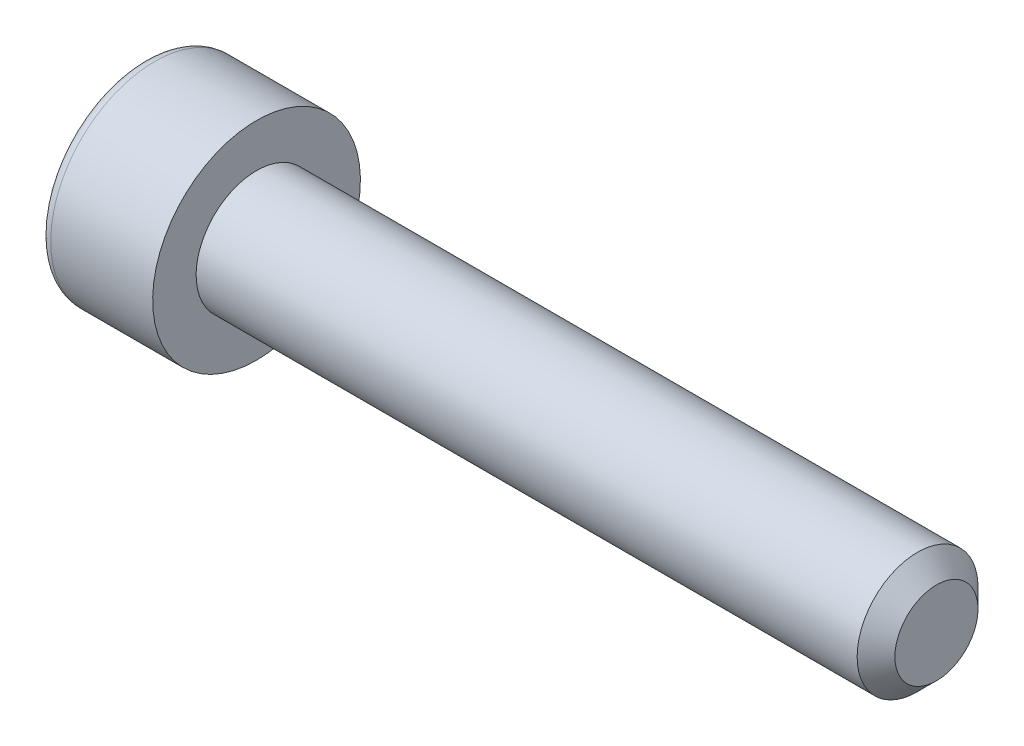
ISO-10303-21;
HEADER;
FILE_DESCRIPTION(('STEP AP214'),'2;1');
FILE_NAME('part.step','',(''),(''),'','','');
FILE_SCHEMA(('AUTOMOTIVE_DESIGN { 1 0 10303 214 1 1 1 1 }'));
ENDSEC;
DATA;
#1=APPLICATION_CONTEXT('core data for automotive mechanical design processes');
#2=APPLICATION_PROTOCOL_DEFINITION('international standard','automotive_design',2000,#1);
#3=PRODUCT_CONTEXT('',#1,'mechanical');
#4=PRODUCT('Part','Part','',(#3));
#5=PRODUCT_RELATED_PRODUCT_CATEGORY('part','',(#4));
#6=PRODUCT_DEFINITION_FORMATION('','',#4);
#7=PRODUCT_DEFINITION_CONTEXT('part definition',#1,'design');
#8=PRODUCT_DEFINITION('design','',#6,#7);
#9=PRODUCT_DEFINITION_SHAPE('','',#8);
#10=(LENGTH_UNIT() NAMED_UNIT(*) SI_UNIT(.MILLI.,.METRE.));
#11=(NAMED_UNIT(*) PLANE_ANGLE_UNIT() SI_UNIT($,.RADIAN.));
#12=(NAMED_UNIT(*) SI_UNIT($,.STERADIAN.) SOLID_ANGLE_UNIT());
#13=UNCERTAINTY_MEASURE_WITH_UNIT(LENGTH_MEASURE(1.E-05),#10,'distance_accuracy_value','');
#14=(GEOMETRIC_REPRESENTATION_CONTEXT(3) GLOBAL_UNCERTAINTY_ASSIGNED_CONTEXT((#13)) GLOBAL_UNIT_ASSIGNED_CONTEXT((#10,
#11,#12)) REPRESENTATION_CONTEXT('',''));
#15=CARTESIAN_POINT('',(0.,0.,0.));
#16=DIRECTION('',(0.,0.,1.));
#17=DIRECTION('',(1.,0.,0.));
#18=AXIS2_PLACEMENT_3D('',#15,#16,#17);
#19=CARTESIAN_POINT('',(-1.70000000002801,0.,0.));
#20=DIRECTION('',(-1.,0.,0.));
#21=DIRECTION('',(0.,0.,1.));
#22=AXIS2_PLACEMENT_3D('',#19,#20,#21);
#23=CONICAL_SURFACE('',#22,1.43650000001117,1.04719755119831);
#24=CARTESIAN_POINT('',(-0.870636338333952,0.,0.));
#25=VERTEX_POINT('',#24);
#26=VERTEX_LOOP('',#25);
#27=FACE_BOUND('',#26,.T.);
#28=CARTESIAN_POINT('',(-1.69999999996238,0.,0.));
#29=DIRECTION('',(-1.,0.,0.));
#30=DIRECTION('',(0.,0.,1.));
#31=AXIS2_PLACEMENT_3D('',#28,#29,#30);
#32=CIRCLE('',#31,1.43649999989748);
#33=CARTESIAN_POINT('',(-1.69999999996238,-0.718249999948738,-1.24404549244756));
#34=VERTEX_POINT('',#33);
#35=CARTESIAN_POINT('',(-1.69999999996238,-1.43649999989748,0.));
#36=VERTEX_POINT('',#35);
#37=EDGE_CURVE('E128',#34,#36,#32,.T.);
#38=ORIENTED_EDGE('',*,*,#37,.T.);
#39=CARTESIAN_POINT('',(-1.70000000002801,0.,0.));
#40=DIRECTION('',(-1.,0.,0.));
#41=DIRECTION('',(0.,0.,1.));
#42=AXIS2_PLACEMENT_3D('',#39,#40,#41);
#43=CIRCLE('',#42,1.43650000001117);
#44=CARTESIAN_POINT('',(-1.70000000002801,-0.718250000005583,1.24404549254602));
#45=VERTEX_POINT('',#44);
#46=EDGE_CURVE('E78',#36,#45,#43,.T.);
#47=ORIENTED_EDGE('',*,*,#46,.T.);
#48=CARTESIAN_POINT('',(-1.70000000002801,0.,0.));
#49=DIRECTION('',(-1.,0.,0.));
#50=DIRECTION('',(0.,0.,1.));
#51=AXIS2_PLACEMENT_3D('',#48,#49,#50);
#52=CIRCLE('',#51,1.43650000001117);
#53=CARTESIAN_POINT('',(-1.70000000002801,0.718250000005582,1.24404549254602));
#54=VERTEX_POINT('',#53);
#55=EDGE_CURVE('E136',#45,#54,#52,.T.);
#56=ORIENTED_EDGE('',*,*,#55,.T.);
#57=CARTESIAN_POINT('',(-1.70000000002801,0.,0.));
#58=DIRECTION('',(-1.,0.,0.));
#59=DIRECTION('',(0.,0.,1.));
#60=AXIS2_PLACEMENT_3D('',#57,#58,#59);
#61=CIRCLE('',#60,1.43650000001116);
#62=CARTESIAN_POINT('',(-1.70000000001401,1.43650000000558,9.66880570697553E-12));
#63=VERTEX_POINT('',#62);
#64=EDGE_CURVE('E134',#54,#63,#61,.T.);
#65=ORIENTED_EDGE('',*,*,#64,.T.);
#66=CARTESIAN_POINT('',(-1.70000000002801,0.,0.));
#67=DIRECTION('',(-1.,0.,0.));
#68=DIRECTION('',(0.,0.,1.));
#69=AXIS2_PLACEMENT_3D('',#66,#67,#68);
#70=CIRCLE('',#69,1.43650000001117);
#71=CARTESIAN_POINT('',(-1.70000000002801,0.718250000005581,-1.24404549254602));
#72=VERTEX_POINT('',#71);
#73=EDGE_CURVE('E132',#63,#72,#70,.T.);
#74=ORIENTED_EDGE('',*,*,#73,.T.);
#75=CARTESIAN_POINT('',(-1.70000000002801,0.,0.));
#76=DIRECTION('',(-1.,0.,0.));
#77=DIRECTION('',(0.,0.,1.));
#78=AXIS2_PLACEMENT_3D('',#75,#76,#77);
#79=CIRCLE('',#78,1.43650000001117);
#80=EDGE_CURVE('E130',#72,#34,#79,.T.);
#81=ORIENTED_EDGE('',*,*,#80,.T.);
#82=EDGE_LOOP('',(#38,#47,#56,#65,#74,#81));
#83=FACE_BOUND('',#82,.T.);
#84=ADVANCED_FACE('F18',(#27,#83),#23,.F.);
#85=CARTESIAN_POINT('',(-1.7,0.,0.));
#86=DIRECTION('',(-1.,0.,0.));
#87=DIRECTION('',(0.,-1.,0.));
#88=AXIS2_PLACEMENT_3D('',#85,#86,#87);
#89=PLANE('',#88);
#90=ORIENTED_EDGE('',*,*,#55,.F.);
#91=DIRECTION('',(0.,1.,0.));
#92=VECTOR('',#91,1.);
#93=CARTESIAN_POINT('',(-1.7,-0.71825,1.24404549253635));
#94=LINE('',#93,#92);
#95=EDGE_CURVE('E92',#45,#54,#94,.T.);
#96=ORIENTED_EDGE('',*,*,#95,.T.);
#97=EDGE_LOOP('',(#90,#96));
#98=FACE_BOUND('',#97,.T.);
#99=ADVANCED_FACE('F201',(#98),#89,.F.);
#100=CARTESIAN_POINT('',(-1.7,0.,0.));
#101=DIRECTION('',(-1.,0.,0.));
#102=DIRECTION('',(0.,-1.,0.));
#103=AXIS2_PLACEMENT_3D('',#100,#101,#102);
#104=PLANE('',#103);
#105=ORIENTED_EDGE('',*,*,#64,.F.);
#106=DIRECTION('',(0.,-0.5,0.866025403784439));
#107=VECTOR('',#106,1.);
#108=CARTESIAN_POINT('',(-1.7,0.71825,1.24404549253635));
#109=LINE('',#108,#107);
#110=EDGE_CURVE('E414',#54,#63,#109,.F.);
#111=ORIENTED_EDGE('',*,*,#110,.T.);
#112=EDGE_LOOP('',(#105,#111));
#113=FACE_BOUND('',#112,.T.);
#114=ADVANCED_FACE('F198',(#113),#104,.F.);
#115=CARTESIAN_POINT('',(-1.7,0.,0.));
#116=DIRECTION('',(-1.,0.,0.));
#117=DIRECTION('',(0.,-1.,0.));
#118=AXIS2_PLACEMENT_3D('',#115,#116,#117);
#119=PLANE('',#118);
#120=ORIENTED_EDGE('',*,*,#73,.F.);
#121=DIRECTION('',(0.,0.5,0.866025403784439));
#122=VECTOR('',#121,1.);
#123=CARTESIAN_POINT('',(-1.7,1.4365,0.));
#124=LINE('',#123,#122);
#125=EDGE_CURVE('E403',#63,#72,#124,.F.);
#126=ORIENTED_EDGE('',*,*,#125,.T.);
#127=EDGE_LOOP('',(#120,#126));
#128=FACE_BOUND('',#127,.T.);
#129=ADVANCED_FACE('F194',(#128),#119,.F.);
#130=CARTESIAN_POINT('',(-1.7,0.,0.));
#131=DIRECTION('',(-1.,0.,0.));
#132=DIRECTION('',(0.,-1.,0.));
#133=AXIS2_PLACEMENT_3D('',#130,#131,#132);
#134=PLANE('',#133);
#135=ORIENTED_EDGE('',*,*,#80,.F.);
#136=DIRECTION('',(0.,1.,0.));
#137=VECTOR('',#136,1.);
#138=CARTESIAN_POINT('',(-1.7,0.71825,-1.24404549253635));
#139=LINE('',#138,#137);
#140=EDGE_CURVE('E392',#72,#34,#139,.F.);
#141=ORIENTED_EDGE('',*,*,#140,.T.);
#142=EDGE_LOOP('',(#135,#141));
#143=FACE_BOUND('',#142,.T.);
#144=ADVANCED_FACE('F190',(#143),#134,.F.);
#145=CARTESIAN_POINT('',(-1.7,0.,0.));
#146=DIRECTION('',(-1.,0.,0.));
#147=DIRECTION('',(0.,-1.,0.));
#148=AXIS2_PLACEMENT_3D('',#145,#146,#147);
#149=PLANE('',#148);
#150=ORIENTED_EDGE('',*,*,#37,.F.);
#151=DIRECTION('',(0.,0.499999999999999,-0.866025403784439));
#152=VECTOR('',#151,1.);
#153=CARTESIAN_POINT('',(-1.7,-0.71825,-1.24404549253635));
#154=LINE('',#153,#152);
#155=EDGE_CURVE('E374',#34,#36,#154,.F.);
#156=ORIENTED_EDGE('',*,*,#155,.T.);
#157=EDGE_LOOP('',(#150,#156));
#158=FACE_BOUND('',#157,.T.);
#159=ADVANCED_FACE('F186',(#158),#149,.F.);
#160=CARTESIAN_POINT('',(-1.7,0.,0.));
#161=DIRECTION('',(-1.,0.,0.));
#162=DIRECTION('',(0.,-1.,0.));
#163=AXIS2_PLACEMENT_3D('',#160,#161,#162);
#164=PLANE('',#163);
#165=ORIENTED_EDGE('',*,*,#46,.F.);
#166=DIRECTION('',(0.,-0.5,-0.866025403784439));
#167=VECTOR('',#166,1.);
#168=CARTESIAN_POINT('',(-1.7,-1.4365,0.));
#169=LINE('',#168,#167);
#170=EDGE_CURVE('E95',#36,#45,#169,.F.);
#171=ORIENTED_EDGE('',*,*,#170,.T.);
#172=EDGE_LOOP('',(#165,#171));
#173=FACE_BOUND('',#172,.T.);
#174=ADVANCED_FACE('F183',(#173),#164,.F.);
#175=CARTESIAN_POINT('',(-1.7,-0.71825,1.24404549253635));
#176=DIRECTION('',(0.,0.,1.));
#177=DIRECTION('',(1.,0.,0.));
#178=AXIS2_PLACEMENT_3D('',#175,#176,#177);
#179=PLANE('',#178);
#180=DIRECTION('',(1.,0.,0.));
#181=VECTOR('',#180,1.);
#182=CARTESIAN_POINT('',(-1.7,0.71825,1.24404549253635));
#183=LINE('',#182,#181);
#184=CARTESIAN_POINT('',(-3.,0.71825,1.24404549253635));
#185=VERTEX_POINT('',#184);
#186=EDGE_CURVE('E379',#185,#54,#183,.T.);
#187=ORIENTED_EDGE('',*,*,#186,.T.);
#188=ORIENTED_EDGE('',*,*,#95,.F.);
#189=DIRECTION('',(1.,0.,0.));
#190=VECTOR('',#189,1.);
#191=CARTESIAN_POINT('',(-1.7,-0.718250000000002,1.24404549253635));
#192=LINE('',#191,#190);
#193=CARTESIAN_POINT('',(-3.,-0.718250000000001,1.24404549253635));
#194=VERTEX_POINT('',#193);
#195=EDGE_CURVE('E84',#45,#194,#192,.F.);
#196=ORIENTED_EDGE('',*,*,#195,.T.);
#197=DIRECTION('',(0.,1.,0.));
#198=VECTOR('',#197,1.);
#199=CARTESIAN_POINT('',(-3.,1.4365,1.24404549253635));
#200=LINE('',#199,#198);
#201=EDGE_CURVE('E89',#194,#185,#200,.T.);
#202=ORIENTED_EDGE('',*,*,#201,.T.);
#203=EDGE_LOOP('',(#187,#188,#196,#202));
#204=FACE_BOUND('',#203,.T.);
#205=ADVANCED_FACE('F87',(#204),#179,.F.);
#206=CARTESIAN_POINT('',(-1.7,0.71825,1.24404549253635));
#207=DIRECTION('',(0.,0.866025403784439,0.5));
#208=DIRECTION('',(0.,-0.5,0.866025403784439));
#209=AXIS2_PLACEMENT_3D('',#206,#207,#208);
#210=PLANE('',#209);
#211=DIRECTION('',(1.,0.,0.));
#212=VECTOR('',#211,1.);
#213=CARTESIAN_POINT('',(-1.7,1.4365,0.));
#214=LINE('',#213,#212);
#215=CARTESIAN_POINT('',(-3.,1.4365,0.));
#216=VERTEX_POINT('',#215);
#217=EDGE_CURVE('E408',#216,#63,#214,.T.);
#218=ORIENTED_EDGE('',*,*,#217,.T.);
#219=ORIENTED_EDGE('',*,*,#110,.F.);
#220=ORIENTED_EDGE('',*,*,#186,.F.);
#221=DIRECTION('',(0.,0.499999999999999,-0.866025403784439));
#222=VECTOR('',#221,1.);
#223=CARTESIAN_POINT('',(-3.,0.71825,1.24404549253635));
#224=LINE('',#223,#222);
#225=EDGE_CURVE('E110',#185,#216,#224,.T.);
#226=ORIENTED_EDGE('',*,*,#225,.T.);
#227=EDGE_LOOP('',(#218,#219,#220,#226));
#228=FACE_BOUND('',#227,.T.);
#229=ADVANCED_FACE('F176',(#228),#210,.F.);
#230=CARTESIAN_POINT('',(-1.7,1.4365,0.));
#231=DIRECTION('',(0.,0.866025403784439,-0.5));
#232=DIRECTION('',(0.,0.5,0.866025403784439));
#233=AXIS2_PLACEMENT_3D('',#230,#231,#232);
#234=PLANE('',#233);
#235=DIRECTION('',(-1.,0.,0.));
#236=VECTOR('',#235,1.);
#237=CARTESIAN_POINT('',(-1.7,0.71825,-1.24404549253635));
#238=LINE('',#237,#236);
#239=CARTESIAN_POINT('',(-3.,0.71825,-1.24404549253635));
#240=VERTEX_POINT('',#239);
#241=EDGE_CURVE('E397',#240,#72,#238,.F.);
#242=ORIENTED_EDGE('',*,*,#241,.T.);
#243=ORIENTED_EDGE('',*,*,#125,.F.);
#244=ORIENTED_EDGE('',*,*,#217,.F.);
#245=DIRECTION('',(0.,-0.500000000000001,-0.866025403784438));
#246=VECTOR('',#245,1.);
#247=CARTESIAN_POINT('',(-3.,1.4365,0.));
#248=LINE('',#247,#246);
#249=EDGE_CURVE('E112',#216,#240,#248,.T.);
#250=ORIENTED_EDGE('',*,*,#249,.T.);
#251=EDGE_LOOP('',(#242,#243,#244,#250));
#252=FACE_BOUND('',#251,.T.);
#253=ADVANCED_FACE('F172',(#252),#234,.F.);
#254=CARTESIAN_POINT('',(-1.7,0.71825,-1.24404549253635));
#255=DIRECTION('',(0.,0.,-1.));
#256=DIRECTION('',(-1.,0.,0.));
#257=AXIS2_PLACEMENT_3D('',#254,#255,#256);
#258=PLANE('',#257);
#259=DIRECTION('',(1.,0.,0.));
#260=VECTOR('',#259,1.);
#261=CARTESIAN_POINT('',(-1.7,-0.71825,-1.24404549253635));
#262=LINE('',#261,#260);
#263=CARTESIAN_POINT('',(-3.,-0.71825,-1.24404549253635));
#264=VERTEX_POINT('',#263);
#265=EDGE_CURVE('E383',#264,#34,#262,.T.);
#266=ORIENTED_EDGE('',*,*,#265,.T.);
#267=ORIENTED_EDGE('',*,*,#140,.F.);
#268=ORIENTED_EDGE('',*,*,#241,.F.);
#269=DIRECTION('',(0.,1.,0.));
#270=VECTOR('',#269,1.);
#271=CARTESIAN_POINT('',(-3.,1.4365,-1.24404549253634));
#272=LINE('',#271,#270);
#273=EDGE_CURVE('E385',#240,#264,#272,.F.);
#274=ORIENTED_EDGE('',*,*,#273,.T.);
#275=EDGE_LOOP('',(#266,#267,#268,#274));
#276=FACE_BOUND('',#275,.T.);
#277=ADVANCED_FACE('F168',(#276),#258,.F.);
#278=CARTESIAN_POINT('',(-1.7,-0.71825,-1.24404549253635));
#279=DIRECTION('',(0.,-0.866025403784439,-0.499999999999999));
#280=DIRECTION('',(0.,0.499999999999999,-0.866025403784439));
#281=AXIS2_PLACEMENT_3D('',#278,#279,#280);
#282=PLANE('',#281);
#283=DIRECTION('',(1.,0.,0.));
#284=VECTOR('',#283,1.);
#285=CARTESIAN_POINT('',(-1.7,-1.4365,0.));
#286=LINE('',#285,#284);
#287=CARTESIAN_POINT('',(-3.,-1.4365,0.));
#288=VERTEX_POINT('',#287);
#289=EDGE_CURVE('E102',#288,#36,#286,.T.);
#290=ORIENTED_EDGE('',*,*,#289,.T.);
#291=ORIENTED_EDGE('',*,*,#155,.F.);
#292=ORIENTED_EDGE('',*,*,#265,.F.);
#293=DIRECTION('',(0.,-0.499999999999999,0.866025403784439));
#294=VECTOR('',#293,1.);
#295=CARTESIAN_POINT('',(-3.,-0.71825,-1.24404549253635));
#296=LINE('',#295,#294);
#297=EDGE_CURVE('E105',#264,#288,#296,.T.);
#298=ORIENTED_EDGE('',*,*,#297,.T.);
#299=EDGE_LOOP('',(#290,#291,#292,#298));
#300=FACE_BOUND('',#299,.T.);
#301=ADVANCED_FACE('F165',(#300),#282,.F.);
#302=CARTESIAN_POINT('',(-1.7,-1.4365,0.));
#303=DIRECTION('',(0.,-0.866025403784439,0.5));
#304=DIRECTION('',(0.,-0.5,-0.866025403784439));
#305=AXIS2_PLACEMENT_3D('',#302,#303,#304);
#306=PLANE('',#305);
#307=ORIENTED_EDGE('',*,*,#195,.F.);
#308=ORIENTED_EDGE('',*,*,#170,.F.);
#309=ORIENTED_EDGE('',*,*,#289,.F.);
#310=DIRECTION('',(0.,0.499999999999999,0.866025403784439));
#311=VECTOR('',#310,1.);
#312=CARTESIAN_POINT('',(-3.,-1.4365,0.));
#313=LINE('',#312,#311);
#314=EDGE_CURVE('E99',#288,#194,#313,.T.);
#315=ORIENTED_EDGE('',*,*,#314,.T.);
#316=EDGE_LOOP('',(#307,#308,#309,#315));
#317=FACE_BOUND('',#316,.T.);
#318=ADVANCED_FACE('F100',(#317),#306,.F.);
#319=CARTESIAN_POINT('',(-3.,1.4365,0.));
#320=DIRECTION('',(1.,0.,0.));
#321=DIRECTION('',(0.,1.,0.));
#322=AXIS2_PLACEMENT_3D('',#319,#320,#321);
#323=PLANE('',#322);
#324=CARTESIAN_POINT('',(-3.,0.,0.));
#325=DIRECTION('',(1.,0.,0.));
#326=DIRECTION('',(0.,-1.,0.));
#327=AXIS2_PLACEMENT_3D('',#324,#325,#326);
#328=CIRCLE('',#327,2.45);
#329=CARTESIAN_POINT('',(-3.,-2.45,0.));
#330=VERTEX_POINT('',#329);
#331=CARTESIAN_POINT('',(-3.,2.45,0.));
#332=VERTEX_POINT('',#331);
#333=EDGE_CURVE('E37',#330,#332,#328,.T.);
#334=ORIENTED_EDGE('',*,*,#333,.F.);
#335=CARTESIAN_POINT('',(-3.,0.,0.));
#336=DIRECTION('',(1.,0.,0.));
#337=DIRECTION('',(0.,1.,0.));
#338=AXIS2_PLACEMENT_3D('',#335,#336,#337);
#339=CIRCLE('',#338,2.45);
#340=EDGE_CURVE('E140',#332,#330,#339,.T.);
#341=ORIENTED_EDGE('',*,*,#340,.F.);
#342=EDGE_LOOP('',(#334,#341));
#343=FACE_BOUND('',#342,.T.);
#344=ORIENTED_EDGE('',*,*,#297,.F.);
#345=ORIENTED_EDGE('',*,*,#273,.F.);
#346=ORIENTED_EDGE('',*,*,#249,.F.);
#347=ORIENTED_EDGE('',*,*,#225,.F.);
#348=ORIENTED_EDGE('',*,*,#201,.F.);
#349=ORIENTED_EDGE('',*,*,#314,.F.);
#350=EDGE_LOOP('',(#344,#345,#346,#347,#348,#349));
#351=FACE_BOUND('',#350,.T.);
#352=ADVANCED_FACE('F108',(#343,#351),#323,.F.);
#353=CARTESIAN_POINT('',(-2.7,0.,0.));
#354=DIRECTION('',(-1.,0.,0.));
#355=DIRECTION('',(0.,1.,0.));
#356=AXIS2_PLACEMENT_3D('',#353,#354,#355);
#357=TOROIDAL_SURFACE('',#356,2.45,0.3);
#358=ORIENTED_EDGE('',*,*,#333,.T.);
#359=ORIENTED_EDGE('',*,*,#340,.T.);
#360=EDGE_LOOP('',(#358,#359));
#361=FACE_BOUND('',#360,.T.);
#362=CARTESIAN_POINT('',(-2.7,0.,0.));
#363=DIRECTION('',(-1.,0.,0.));
#364=DIRECTION('',(0.,-1.,0.));
#365=AXIS2_PLACEMENT_3D('',#362,#363,#364);
#366=CIRCLE('',#365,2.75);
#367=CARTESIAN_POINT('',(-2.7,-2.75,0.));
#368=VERTEX_POINT('',#367);
#369=EDGE_CURVE('E126',#368,#368,#366,.F.);
#370=ORIENTED_EDGE('',*,*,#369,.F.);
#371=EDGE_LOOP('',(#370));
#372=FACE_BOUND('',#371,.T.);
#373=ADVANCED_FACE('F138',(#361,#372),#357,.T.);
#374=CARTESIAN_POINT('',(18.,0.,0.));
#375=DIRECTION('',(1.,0.,0.));
#376=DIRECTION('',(0.,0.,-1.));
#377=AXIS2_PLACEMENT_3D('',#374,#375,#376);
#378=PLANE('',#377);
#379=CARTESIAN_POINT('',(17.9999999999723,0.,0.));
#380=DIRECTION('',(-1.,0.,0.));
#381=DIRECTION('',(0.,0.,1.));
#382=AXIS2_PLACEMENT_3D('',#379,#380,#381);
#383=CIRCLE('',#382,1.1000000000081);
#384=CARTESIAN_POINT('',(17.9999999999723,0.,1.1000000000081));
#385=VERTEX_POINT('',#384);
#386=EDGE_CURVE('E123',#385,#385,#383,.T.);
#387=ORIENTED_EDGE('',*,*,#386,.F.);
#388=EDGE_LOOP('',(#387));
#389=FACE_BOUND('',#388,.T.);
#390=ADVANCED_FACE('F228',(#389),#378,.T.);
#391=CARTESIAN_POINT('',(-0.870636338309101,0.,0.));
#392=DIRECTION('',(-1.,0.,0.));
#393=DIRECTION('',(0.,-1.,0.));
#394=AXIS2_PLACEMENT_3D('',#391,#392,#393);
#395=CYLINDRICAL_SURFACE('',#394,2.75);
#396=ORIENTED_EDGE('',*,*,#369,.T.);
#397=EDGE_LOOP('',(#396));
#398=FACE_BOUND('',#397,.T.);
#399=CARTESIAN_POINT('',(0.,0.,0.));
#400=DIRECTION('',(-1.,0.,0.));
#401=DIRECTION('',(0.,-1.,0.));
#402=AXIS2_PLACEMENT_3D('',#399,#400,#401);
#403=CIRCLE('',#402,2.75);
#404=CARTESIAN_POINT('',(0.,-2.75,0.));
#405=VERTEX_POINT('',#404);
#406=EDGE_CURVE('E120',#405,#405,#403,.T.);
#407=ORIENTED_EDGE('',*,*,#406,.T.);
#408=EDGE_LOOP('',(#407));
#409=FACE_BOUND('',#408,.T.);
#410=ADVANCED_FACE('F225',(#398,#409),#395,.T.);
#411=CARTESIAN_POINT('',(17.4999999999841,0.,0.));
#412=DIRECTION('',(-1.,0.,0.));
#413=DIRECTION('',(0.,0.,1.));
#414=AXIS2_PLACEMENT_3D('',#411,#412,#413);
#415=CONICAL_SURFACE('',#414,1.59999999999627,0.785398163397448);
#416=CARTESIAN_POINT('',(17.5,0.,0.));
#417=DIRECTION('',(-1.,0.,0.));
#418=DIRECTION('',(0.,-1.,0.));
#419=AXIS2_PLACEMENT_3D('',#416,#417,#418);
#420=CIRCLE('',#419,1.6);
#421=CARTESIAN_POINT('',(17.5,-1.6,0.));
#422=VERTEX_POINT('',#421);
#423=EDGE_CURVE('E29',#422,#422,#420,.T.);
#424=ORIENTED_EDGE('',*,*,#423,.F.);
#425=EDGE_LOOP('',(#424));
#426=FACE_BOUND('',#425,.T.);
#427=ORIENTED_EDGE('',*,*,#386,.T.);
#428=EDGE_LOOP('',(#427));
#429=FACE_BOUND('',#428,.T.);
#430=ADVANCED_FACE('F218',(#426,#429),#415,.T.);
#431=CARTESIAN_POINT('',(0.,2.75,0.));
#432=DIRECTION('',(-1.,0.,0.));
#433=DIRECTION('',(0.,-1.,0.));
#434=AXIS2_PLACEMENT_3D('',#431,#432,#433);
#435=PLANE('',#434);
#436=CARTESIAN_POINT('',(0.,0.,0.));
#437=DIRECTION('',(-1.,0.,0.));
#438=DIRECTION('',(0.,-1.,0.));
#439=AXIS2_PLACEMENT_3D('',#436,#437,#438);
#440=CIRCLE('',#439,1.6);
#441=CARTESIAN_POINT('',(0.,-1.6,0.));
#442=VERTEX_POINT('',#441);
#443=EDGE_CURVE('E11',#442,#442,#440,.F.);
#444=ORIENTED_EDGE('',*,*,#443,.F.);
#445=EDGE_LOOP('',(#444));
#446=FACE_BOUND('',#445,.T.);
#447=ORIENTED_EDGE('',*,*,#406,.F.);
#448=EDGE_LOOP('',(#447));
#449=FACE_BOUND('',#448,.T.);
#450=ADVANCED_FACE('F212',(#446,#449),#435,.F.);
#451=CARTESIAN_POINT('',(16.,0.,0.));
#452=DIRECTION('',(-1.,0.,0.));
#453=DIRECTION('',(0.,-1.,0.));
#454=AXIS2_PLACEMENT_3D('',#451,#452,#453);
#455=CYLINDRICAL_SURFACE('',#454,1.6);
#456=ORIENTED_EDGE('',*,*,#443,.T.);
#457=EDGE_LOOP('',(#456));
#458=FACE_BOUND('',#457,.T.);
#459=ORIENTED_EDGE('',*,*,#423,.T.);
#460=EDGE_LOOP('',(#459));
#461=FACE_BOUND('',#460,.T.);
#462=ADVANCED_FACE('F210',(#458,#461),#455,.T.);
#463=CLOSED_SHELL('',(#84,#99,#114,#129,#144,#159,#174,#205,#229,#253,#277,#301,#318,#352,#373,
#390,#410,#430,#450,#462));
#464=MANIFOLD_SOLID_BREP('B1',#463);
#465=ADVANCED_BREP_SHAPE_REPRESENTATION('',(#18,#464),#14);
#466=SHAPE_DEFINITION_REPRESENTATION(#9,#465);
ENDSEC;
END-ISO-10303-21;
